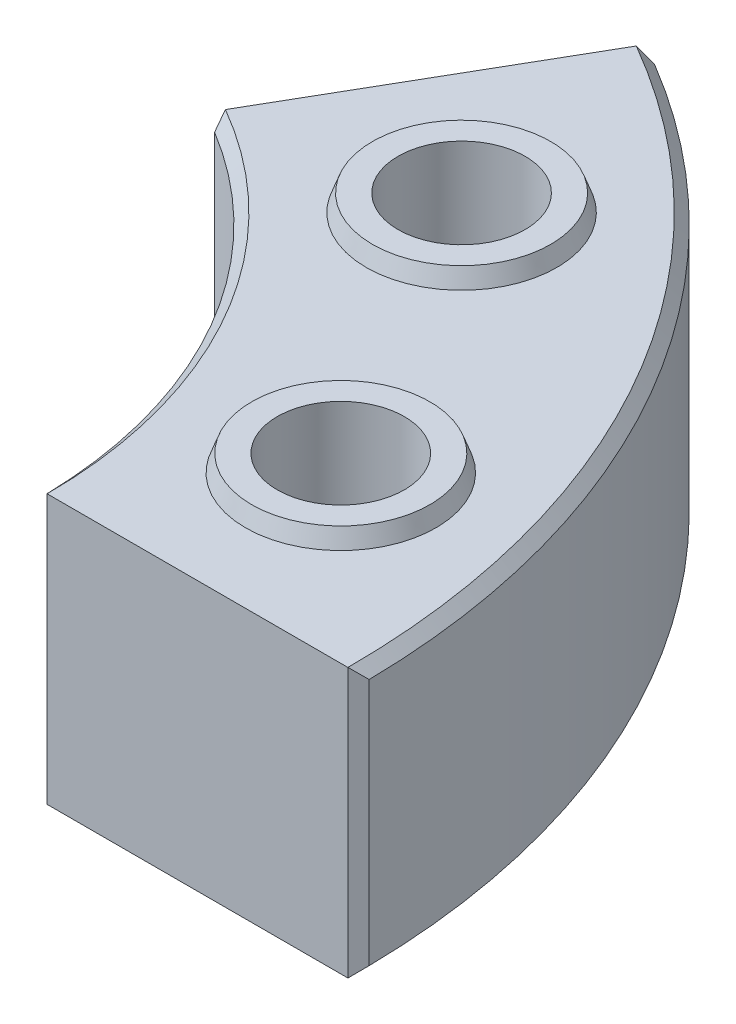
ISO-10303-21;
HEADER;
FILE_DESCRIPTION(('STEP AP214'),'2;1');
FILE_NAME('part.step','',(''),(''),'','','');
FILE_SCHEMA(('AUTOMOTIVE_DESIGN { 1 0 10303 214 1 1 1 1 }'));
ENDSEC;
DATA;
#1=APPLICATION_CONTEXT('core data for automotive mechanical design processes');
#2=APPLICATION_PROTOCOL_DEFINITION('international standard','automotive_design',2000,#1);
#3=PRODUCT_CONTEXT('',#1,'mechanical');
#4=PRODUCT('Part','Part','',(#3));
#5=PRODUCT_RELATED_PRODUCT_CATEGORY('part','',(#4));
#6=PRODUCT_DEFINITION_FORMATION('','',#4);
#7=PRODUCT_DEFINITION_CONTEXT('part definition',#1,'design');
#8=PRODUCT_DEFINITION('design','',#6,#7);
#9=PRODUCT_DEFINITION_SHAPE('','',#8);
#10=(LENGTH_UNIT() NAMED_UNIT(*) SI_UNIT(.MILLI.,.METRE.));
#11=(NAMED_UNIT(*) PLANE_ANGLE_UNIT() SI_UNIT($,.RADIAN.));
#12=(NAMED_UNIT(*) SI_UNIT($,.STERADIAN.) SOLID_ANGLE_UNIT());
#13=UNCERTAINTY_MEASURE_WITH_UNIT(LENGTH_MEASURE(1.E-05),#10,'distance_accuracy_value','');
#14=(GEOMETRIC_REPRESENTATION_CONTEXT(3) GLOBAL_UNCERTAINTY_ASSIGNED_CONTEXT((#13)) GLOBAL_UNIT_ASSIGNED_CONTEXT((#10,
#11,#12)) REPRESENTATION_CONTEXT('',''));
#15=CARTESIAN_POINT('',(0.,0.,0.));
#16=DIRECTION('',(0.,0.,1.));
#17=DIRECTION('',(1.,0.,0.));
#18=AXIS2_PLACEMENT_3D('',#15,#16,#17);
#19=CARTESIAN_POINT('',(212.839141137151,-127.,-212.839141137151));
#20=DIRECTION('',(0.,1.,0.));
#21=DIRECTION('',(0.,0.,1.));
#22=AXIS2_PLACEMENT_3D('',#19,#20,#21);
#23=CYLINDRICAL_SURFACE('',#22,30.);
#24=CARTESIAN_POINT('',(212.839141137151,8.,-212.839141137151));
#25=DIRECTION('',(0.,1.,0.));
#26=DIRECTION('',(0.,0.,1.));
#27=AXIS2_PLACEMENT_3D('',#24,#25,#26);
#28=CIRCLE('',#27,30.);
#29=CARTESIAN_POINT('',(212.839141137151,8.,-182.839141137151));
#30=VERTEX_POINT('',#29);
#31=EDGE_CURVE('E399',#30,#30,#28,.T.);
#32=ORIENTED_EDGE('',*,*,#31,.T.);
#33=EDGE_LOOP('',(#32));
#34=FACE_BOUND('',#33,.T.);
#35=CARTESIAN_POINT('',(212.839141137151,-117.,-212.839141137151));
#36=DIRECTION('',(0.,-1.,0.));
#37=DIRECTION('',(0.,0.,-1.));
#38=AXIS2_PLACEMENT_3D('',#35,#36,#37);
#39=CIRCLE('',#38,30.);
#40=CARTESIAN_POINT('',(212.839141137151,-117.,-242.839141137151));
#41=VERTEX_POINT('',#40);
#42=EDGE_CURVE('E239',#41,#41,#39,.T.);
#43=ORIENTED_EDGE('',*,*,#42,.T.);
#44=EDGE_LOOP('',(#43));
#45=FACE_BOUND('',#44,.T.);
#46=ADVANCED_FACE('F35',(#34,#45),#23,.F.);
#47=CARTESIAN_POINT('',(290.743673713006,-127.,-77.9045325758727));
#48=DIRECTION('',(0.,1.,0.));
#49=DIRECTION('',(0.,0.,1.));
#50=AXIS2_PLACEMENT_3D('',#47,#48,#49);
#51=CYLINDRICAL_SURFACE('',#50,30.);
#52=CARTESIAN_POINT('',(290.743673713006,8.,-77.9045325758727));
#53=DIRECTION('',(0.,1.,0.));
#54=DIRECTION('',(0.,0.,1.));
#55=AXIS2_PLACEMENT_3D('',#52,#53,#54);
#56=CIRCLE('',#55,30.);
#57=CARTESIAN_POINT('',(290.743673713006,8.,-47.9045325758727));
#58=VERTEX_POINT('',#57);
#59=EDGE_CURVE('E405',#58,#58,#56,.T.);
#60=ORIENTED_EDGE('',*,*,#59,.T.);
#61=EDGE_LOOP('',(#60));
#62=FACE_BOUND('',#61,.T.);
#63=CARTESIAN_POINT('',(290.743673713006,-117.,-77.9045325758727));
#64=DIRECTION('',(0.,-1.,0.));
#65=DIRECTION('',(0.,0.,-1.));
#66=AXIS2_PLACEMENT_3D('',#63,#64,#65);
#67=CIRCLE('',#66,30.);
#68=CARTESIAN_POINT('',(290.743673713006,-117.,-107.904532575873));
#69=VERTEX_POINT('',#68);
#70=EDGE_CURVE('E431',#69,#69,#67,.T.);
#71=ORIENTED_EDGE('',*,*,#70,.T.);
#72=EDGE_LOOP('',(#71));
#73=FACE_BOUND('',#72,.T.);
#74=ADVANCED_FACE('F283',(#62,#73),#51,.F.);
#75=CARTESIAN_POINT('',(0.,0.,0.));
#76=DIRECTION('',(0.,1.,0.));
#77=DIRECTION('',(0.,0.,1.));
#78=AXIS2_PLACEMENT_3D('',#75,#76,#77);
#79=PLANE('',#78);
#80=CARTESIAN_POINT('',(212.839141137151,0.,-212.839141137151));
#81=DIRECTION('',(0.,1.,0.));
#82=DIRECTION('',(0.,0.,1.));
#83=AXIS2_PLACEMENT_3D('',#80,#81,#82);
#84=CIRCLE('',#83,45.);
#85=CARTESIAN_POINT('',(212.839141137151,0.,-167.839141137151));
#86=VERTEX_POINT('',#85);
#87=EDGE_CURVE('E386',#86,#86,#84,.T.);
#88=ORIENTED_EDGE('',*,*,#87,.F.);
#89=EDGE_LOOP('',(#88));
#90=FACE_BOUND('',#89,.T.);
#91=DIRECTION('',(-0.500000000000001,0.,0.866025403784438));
#92=VECTOR('',#91,1.);
#93=CARTESIAN_POINT('',(188.499999999988,0.,-326.49157722674));
#94=LINE('',#93,#92);
#95=CARTESIAN_POINT('',(185.983198165844,0.,-322.13234857742));
#96=VERTEX_POINT('',#95);
#97=CARTESIAN_POINT('',(114.999999999988,0.,-199.185842870428));
#98=VERTEX_POINT('',#97);
#99=EDGE_CURVE('E379',#96,#98,#94,.T.);
#100=ORIENTED_EDGE('',*,*,#99,.T.);
#101=CARTESIAN_POINT('',(0.,0.,0.));
#102=DIRECTION('',(0.,1.,0.));
#103=DIRECTION('',(0.,0.,1.));
#104=AXIS2_PLACEMENT_3D('',#101,#102,#103);
#105=CIRCLE('',#104,230.);
#106=CARTESIAN_POINT('',(230.,0.,0.));
#107=VERTEX_POINT('',#106);
#108=EDGE_CURVE('E191',#98,#107,#105,.F.);
#109=ORIENTED_EDGE('',*,*,#108,.T.);
#110=DIRECTION('',(1.,0.,0.));
#111=VECTOR('',#110,1.);
#112=CARTESIAN_POINT('',(225.,0.,0.));
#113=LINE('',#112,#111);
#114=CARTESIAN_POINT('',(371.966396331712,0.,0.));
#115=VERTEX_POINT('',#114);
#116=EDGE_CURVE('E372',#107,#115,#113,.T.);
#117=ORIENTED_EDGE('',*,*,#116,.T.);
#118=DIRECTION('',(-0.702338643314229,0.,0.711842981357215));
#119=VECTOR('',#118,1.);
#120=CARTESIAN_POINT('',(188.482972334752,0.,185.966397849462));
#121=LINE('',#120,#119);
#122=CARTESIAN_POINT('',(371.999998441039,0.,-0.0340568270174596));
#123=VERTEX_POINT('',#122);
#124=EDGE_CURVE('E187',#115,#123,#121,.F.);
#125=ORIENTED_EDGE('',*,*,#124,.T.);
#126=CARTESIAN_POINT('',(0.,0.,0.));
#127=DIRECTION('',(0.,1.,0.));
#128=DIRECTION('',(0.,0.,1.));
#129=AXIS2_PLACEMENT_3D('',#126,#127,#128);
#130=CIRCLE('',#129,372.);
#131=CARTESIAN_POINT('',(186.029493297877,0.,-322.144420444209));
#132=VERTEX_POINT('',#131);
#133=EDGE_CURVE('E185',#123,#132,#130,.T.);
#134=ORIENTED_EDGE('',*,*,#133,.T.);
#135=DIRECTION('',(0.967643427018109,0.,-0.252321616491037));
#136=VECTOR('',#135,1.);
#137=CARTESIAN_POINT('',(-66.8101386205494,0.,-256.214241147428));
#138=LINE('',#137,#136);
#139=EDGE_CURVE('E189',#132,#96,#138,.F.);
#140=ORIENTED_EDGE('',*,*,#139,.T.);
#141=EDGE_LOOP('',(#100,#109,#117,#125,#134,#140));
#142=FACE_BOUND('',#141,.T.);
#143=CARTESIAN_POINT('',(290.743673713006,0.,-77.9045325758727));
#144=DIRECTION('',(0.,1.,0.));
#145=DIRECTION('',(0.,0.,1.));
#146=AXIS2_PLACEMENT_3D('',#143,#144,#145);
#147=CIRCLE('',#146,45.);
#148=CARTESIAN_POINT('',(290.743673713006,0.,-32.9045325758727));
#149=VERTEX_POINT('',#148);
#150=EDGE_CURVE('E400',#149,#149,#147,.T.);
#151=ORIENTED_EDGE('',*,*,#150,.F.);
#152=EDGE_LOOP('',(#151));
#153=FACE_BOUND('',#152,.T.);
#154=ADVANCED_FACE('F289',(#90,#142,#153),#79,.T.);
#155=CARTESIAN_POINT('',(0.,-127.,0.));
#156=DIRECTION('',(0.,1.,0.));
#157=DIRECTION('',(0.,0.,1.));
#158=AXIS2_PLACEMENT_3D('',#155,#156,#157);
#159=CYLINDRICAL_SURFACE('',#158,225.);
#160=CARTESIAN_POINT('',(0.,-122.,0.));
#161=DIRECTION('',(0.,1.,0.));
#162=DIRECTION('',(0.,0.,1.));
#163=AXIS2_PLACEMENT_3D('',#160,#161,#162);
#164=CIRCLE('',#163,225.);
#165=CARTESIAN_POINT('',(116.709407505567,-122.,-192.364014825277));
#166=VERTEX_POINT('',#165);
#167=CARTESIAN_POINT('',(224.94682736544,-122.,-4.89130434782609));
#168=VERTEX_POINT('',#167);
#169=EDGE_CURVE('E155',#166,#168,#164,.F.);
#170=ORIENTED_EDGE('',*,*,#169,.T.);
#171=DIRECTION('',(0.,1.,0.));
#172=VECTOR('',#171,1.);
#173=CARTESIAN_POINT('',(224.94682736544,-127.,-4.89130434782609));
#174=LINE('',#173,#172);
#175=CARTESIAN_POINT('',(224.94682736544,-5.00000000000001,-4.89130434782609));
#176=VERTEX_POINT('',#175);
#177=EDGE_CURVE('E135',#168,#176,#174,.T.);
#178=ORIENTED_EDGE('',*,*,#177,.T.);
#179=CARTESIAN_POINT('',(0.,-5.,0.));
#180=DIRECTION('',(0.,1.,0.));
#181=DIRECTION('',(0.,0.,1.));
#182=AXIS2_PLACEMENT_3D('',#179,#180,#181);
#183=CIRCLE('',#182,225.);
#184=CARTESIAN_POINT('',(116.709407505567,-5.00000000000001,-192.364014825277));
#185=VERTEX_POINT('',#184);
#186=EDGE_CURVE('E143',#176,#185,#183,.T.);
#187=ORIENTED_EDGE('',*,*,#186,.T.);
#188=DIRECTION('',(0.,1.,0.));
#189=VECTOR('',#188,1.);
#190=CARTESIAN_POINT('',(116.709407505567,-127.,-192.364014825277));
#191=LINE('',#190,#189);
#192=EDGE_CURVE('E150',#185,#166,#191,.F.);
#193=ORIENTED_EDGE('',*,*,#192,.T.);
#194=EDGE_LOOP('',(#170,#178,#187,#193));
#195=FACE_BOUND('',#194,.T.);
#196=ADVANCED_FACE('F153',(#195),#159,.F.);
#197=CARTESIAN_POINT('',(188.499999999988,-127.,-326.49157722674));
#198=DIRECTION('',(-0.866025403784438,0.,-0.500000000000001));
#199=DIRECTION('',(-0.500000000000001,0.,0.866025403784438));
#200=AXIS2_PLACEMENT_3D('',#197,#198,#199);
#201=PLANE('',#200);
#202=DIRECTION('',(-0.500000000000001,0.,0.866025403784438));
#203=VECTOR('',#202,1.);
#204=CARTESIAN_POINT('',(188.499999999988,-127.,-326.49157722674));
#205=LINE('',#204,#203);
#206=CARTESIAN_POINT('',(185.983198165844,-127.,-322.13234857742));
#207=VERTEX_POINT('',#206);
#208=CARTESIAN_POINT('',(114.999999999988,-127.,-199.185842870428));
#209=VERTEX_POINT('',#208);
#210=EDGE_CURVE('E384',#207,#209,#205,.T.);
#211=ORIENTED_EDGE('',*,*,#210,.T.);
#212=DIRECTION('',(0.353553390593276,-0.707106781186546,-0.612372435695796));
#213=VECTOR('',#212,1.);
#214=CARTESIAN_POINT('',(-1.23309982264346E-11,102.999999999999,-7.11930514540883E-12));
#215=LINE('',#214,#213);
#216=CARTESIAN_POINT('',(114.972822875657,-126.945645751339,-199.138770710284));
#217=VERTEX_POINT('',#216);
#218=EDGE_CURVE('E183',#209,#217,#215,.F.);
#219=ORIENTED_EDGE('',*,*,#218,.T.);
#220=DIRECTION('',(0.,1.,0.));
#221=VECTOR('',#220,1.);
#222=CARTESIAN_POINT('',(114.972822875657,-127.,-199.138770710284));
#223=LINE('',#222,#221);
#224=CARTESIAN_POINT('',(114.972822875657,-0.054354248661348,-199.138770710284));
#225=VERTEX_POINT('',#224);
#226=EDGE_CURVE('E181',#217,#225,#223,.T.);
#227=ORIENTED_EDGE('',*,*,#226,.T.);
#228=DIRECTION('',(-0.353553390593276,-0.707106781186546,0.612372435695796));
#229=VECTOR('',#228,1.);
#230=CARTESIAN_POINT('',(-1.23309982264346E-11,-229.999999999999,-7.11930514540883E-12));
#231=LINE('',#230,#229);
#232=EDGE_CURVE('E179',#225,#98,#231,.F.);
#233=ORIENTED_EDGE('',*,*,#232,.T.);
#234=ORIENTED_EDGE('',*,*,#99,.F.);
#235=DIRECTION('',(0.,-1.,0.));
#236=VECTOR('',#235,1.);
#237=CARTESIAN_POINT('',(185.983198165844,-127.,-322.13234857742));
#238=LINE('',#237,#236);
#239=EDGE_CURVE('E176',#96,#207,#238,.T.);
#240=ORIENTED_EDGE('',*,*,#239,.T.);
#241=EDGE_LOOP('',(#211,#219,#227,#233,#234,#240));
#242=FACE_BOUND('',#241,.T.);
#243=ADVANCED_FACE('F305',(#242),#201,.T.);
#244=CARTESIAN_POINT('',(0.,-127.,0.));
#245=DIRECTION('',(0.,1.,0.));
#246=DIRECTION('',(0.,0.,1.));
#247=AXIS2_PLACEMENT_3D('',#244,#245,#246);
#248=CYLINDRICAL_SURFACE('',#247,377.);
#249=CARTESIAN_POINT('',(0.,-122.,0.));
#250=DIRECTION('',(0.,1.,0.));
#251=DIRECTION('',(0.,0.,1.));
#252=AXIS2_PLACEMENT_3D('',#249,#250,#251);
#253=CIRCLE('',#252,377.);
#254=CARTESIAN_POINT('',(376.965944669504,-122.,-5.0672043010751));
#255=VERTEX_POINT('',#254);
#256=CARTESIAN_POINT('',(192.871299985636,-122.,-323.928482294859));
#257=VERTEX_POINT('',#256);
#258=EDGE_CURVE('E50',#255,#257,#253,.T.);
#259=ORIENTED_EDGE('',*,*,#258,.T.);
#260=DIRECTION('',(0.,1.,0.));
#261=VECTOR('',#260,1.);
#262=CARTESIAN_POINT('',(192.871299985636,-127.,-323.928482294859));
#263=LINE('',#262,#261);
#264=CARTESIAN_POINT('',(192.871299985636,-4.99999999999984,-323.928482294859));
#265=VERTEX_POINT('',#264);
#266=EDGE_CURVE('E11',#257,#265,#263,.T.);
#267=ORIENTED_EDGE('',*,*,#266,.T.);
#268=CARTESIAN_POINT('',(0.,-4.99999999999984,0.));
#269=DIRECTION('',(0.,1.,0.));
#270=DIRECTION('',(0.,0.,1.));
#271=AXIS2_PLACEMENT_3D('',#268,#269,#270);
#272=CIRCLE('',#271,377.);
#273=CARTESIAN_POINT('',(376.965944669504,-4.99999999999984,-5.0672043010751));
#274=VERTEX_POINT('',#273);
#275=EDGE_CURVE('E193',#265,#274,#272,.F.);
#276=ORIENTED_EDGE('',*,*,#275,.T.);
#277=DIRECTION('',(0.,1.,0.));
#278=VECTOR('',#277,1.);
#279=CARTESIAN_POINT('',(376.965944669504,-127.,-5.0672043010751));
#280=LINE('',#279,#278);
#281=EDGE_CURVE('E61',#274,#255,#280,.F.);
#282=ORIENTED_EDGE('',*,*,#281,.T.);
#283=EDGE_LOOP('',(#259,#267,#276,#282));
#284=FACE_BOUND('',#283,.T.);
#285=ADVANCED_FACE('F308',(#284),#248,.T.);
#286=CARTESIAN_POINT('',(225.,-127.,0.));
#287=DIRECTION('',(0.,0.,1.));
#288=DIRECTION('',(1.,0.,0.));
#289=AXIS2_PLACEMENT_3D('',#286,#287,#288);
#290=PLANE('',#289);
#291=DIRECTION('',(0.,-1.,0.));
#292=VECTOR('',#291,1.);
#293=CARTESIAN_POINT('',(229.945645751338,-127.,0.));
#294=LINE('',#293,#292);
#295=CARTESIAN_POINT('',(229.945645751338,-0.0543542486616255,0.));
#296=VERTEX_POINT('',#295);
#297=CARTESIAN_POINT('',(229.945645751338,-126.945645751338,0.));
#298=VERTEX_POINT('',#297);
#299=EDGE_CURVE('E137',#296,#298,#294,.T.);
#300=ORIENTED_EDGE('',*,*,#299,.T.);
#301=DIRECTION('',(-0.707106781186549,0.707106781186546,0.));
#302=VECTOR('',#301,1.);
#303=CARTESIAN_POINT('',(0.,102.999999999999,0.));
#304=LINE('',#303,#302);
#305=CARTESIAN_POINT('',(230.,-127.,0.));
#306=VERTEX_POINT('',#305);
#307=EDGE_CURVE('E166',#298,#306,#304,.F.);
#308=ORIENTED_EDGE('',*,*,#307,.T.);
#309=DIRECTION('',(1.,0.,0.));
#310=VECTOR('',#309,1.);
#311=CARTESIAN_POINT('',(225.,-127.,0.));
#312=LINE('',#311,#310);
#313=CARTESIAN_POINT('',(371.966396331712,-127.,0.));
#314=VERTEX_POINT('',#313);
#315=EDGE_CURVE('E382',#306,#314,#312,.T.);
#316=ORIENTED_EDGE('',*,*,#315,.T.);
#317=DIRECTION('',(0.,1.,0.));
#318=VECTOR('',#317,1.);
#319=CARTESIAN_POINT('',(371.966396331712,-127.,0.));
#320=LINE('',#319,#318);
#321=EDGE_CURVE('E157',#314,#115,#320,.T.);
#322=ORIENTED_EDGE('',*,*,#321,.T.);
#323=ORIENTED_EDGE('',*,*,#116,.F.);
#324=DIRECTION('',(0.707106781186549,0.707106781186546,0.));
#325=VECTOR('',#324,1.);
#326=CARTESIAN_POINT('',(0.,-229.999999999999,0.));
#327=LINE('',#326,#325);
#328=EDGE_CURVE('E159',#107,#296,#327,.F.);
#329=ORIENTED_EDGE('',*,*,#328,.T.);
#330=EDGE_LOOP('',(#300,#308,#316,#322,#323,#329));
#331=FACE_BOUND('',#330,.T.);
#332=ADVANCED_FACE('F300',(#331),#290,.T.);
#333=CARTESIAN_POINT('',(0.,-127.,0.));
#334=DIRECTION('',(0.,1.,0.));
#335=DIRECTION('',(0.,0.,1.));
#336=AXIS2_PLACEMENT_3D('',#333,#334,#335);
#337=PLANE('',#336);
#338=CARTESIAN_POINT('',(290.743673713006,-127.,-77.9045325758727));
#339=DIRECTION('',(0.,-1.,0.));
#340=DIRECTION('',(0.,0.,-1.));
#341=AXIS2_PLACEMENT_3D('',#338,#339,#340);
#342=CIRCLE('',#341,46.);
#343=CARTESIAN_POINT('',(290.743673713006,-127.,-123.904532575873));
#344=VERTEX_POINT('',#343);
#345=EDGE_CURVE('E353',#344,#344,#342,.T.);
#346=ORIENTED_EDGE('',*,*,#345,.F.);
#347=EDGE_LOOP('',(#346));
#348=FACE_BOUND('',#347,.T.);
#349=CARTESIAN_POINT('',(212.839141137151,-127.,-212.839141137151));
#350=DIRECTION('',(0.,-1.,0.));
#351=DIRECTION('',(0.,0.,-1.));
#352=AXIS2_PLACEMENT_3D('',#349,#350,#351);
#353=CIRCLE('',#352,46.);
#354=CARTESIAN_POINT('',(212.839141137151,-127.,-258.839141137151));
#355=VERTEX_POINT('',#354);
#356=EDGE_CURVE('E428',#355,#355,#353,.T.);
#357=ORIENTED_EDGE('',*,*,#356,.F.);
#358=EDGE_LOOP('',(#357));
#359=FACE_BOUND('',#358,.T.);
#360=ORIENTED_EDGE('',*,*,#315,.F.);
#361=CARTESIAN_POINT('',(0.,-127.,0.));
#362=DIRECTION('',(0.,1.,0.));
#363=DIRECTION('',(0.,0.,1.));
#364=AXIS2_PLACEMENT_3D('',#361,#362,#363);
#365=CIRCLE('',#364,230.);
#366=EDGE_CURVE('E174',#306,#209,#365,.T.);
#367=ORIENTED_EDGE('',*,*,#366,.T.);
#368=ORIENTED_EDGE('',*,*,#210,.F.);
#369=DIRECTION('',(-0.967643427018109,0.,0.252321616491037));
#370=VECTOR('',#369,1.);
#371=CARTESIAN_POINT('',(192.871299985637,-127.,-323.928482294859));
#372=LINE('',#371,#370);
#373=CARTESIAN_POINT('',(186.029493297876,-127.,-322.144420444209));
#374=VERTEX_POINT('',#373);
#375=EDGE_CURVE('E172',#207,#374,#372,.F.);
#376=ORIENTED_EDGE('',*,*,#375,.T.);
#377=CARTESIAN_POINT('',(0.,-127.,0.));
#378=DIRECTION('',(0.,1.,0.));
#379=DIRECTION('',(0.,0.,1.));
#380=AXIS2_PLACEMENT_3D('',#377,#378,#379);
#381=CIRCLE('',#380,372.);
#382=CARTESIAN_POINT('',(371.999998441038,-127.,-0.0340568270174034));
#383=VERTEX_POINT('',#382);
#384=EDGE_CURVE('E170',#374,#383,#381,.F.);
#385=ORIENTED_EDGE('',*,*,#384,.T.);
#386=DIRECTION('',(0.702338643314229,0.,-0.711842981357215));
#387=VECTOR('',#386,1.);
#388=CARTESIAN_POINT('',(371.966396331712,-127.,0.));
#389=LINE('',#388,#387);
#390=EDGE_CURVE('E168',#383,#314,#389,.F.);
#391=ORIENTED_EDGE('',*,*,#390,.T.);
#392=EDGE_LOOP('',(#360,#367,#368,#376,#385,#391));
#393=FACE_BOUND('',#392,.T.);
#394=ADVANCED_FACE('F296',(#348,#359,#393),#337,.F.);
#395=CARTESIAN_POINT('',(212.839141137151,8.,-212.839141137151));
#396=DIRECTION('',(0.,1.,0.));
#397=DIRECTION('',(0.,0.,1.));
#398=AXIS2_PLACEMENT_3D('',#395,#396,#397);
#399=PLANE('',#398);
#400=CARTESIAN_POINT('',(212.839141137151,8.,-212.839141137151));
#401=DIRECTION('',(0.,1.,0.));
#402=DIRECTION('',(0.,0.,1.));
#403=AXIS2_PLACEMENT_3D('',#400,#401,#402);
#404=CIRCLE('',#403,42.0882381258705);
#405=CARTESIAN_POINT('',(212.839141137151,8.,-170.750903011281));
#406=VERTEX_POINT('',#405);
#407=EDGE_CURVE('E360',#406,#406,#404,.T.);
#408=ORIENTED_EDGE('',*,*,#407,.T.);
#409=EDGE_LOOP('',(#408));
#410=FACE_BOUND('',#409,.T.);
#411=ORIENTED_EDGE('',*,*,#31,.F.);
#412=EDGE_LOOP('',(#411));
#413=FACE_BOUND('',#412,.T.);
#414=ADVANCED_FACE('F299',(#410,#413),#399,.T.);
#415=CARTESIAN_POINT('',(290.743673713006,8.,-77.9045325758727));
#416=DIRECTION('',(0.,1.,0.));
#417=DIRECTION('',(0.,0.,1.));
#418=AXIS2_PLACEMENT_3D('',#415,#416,#417);
#419=PLANE('',#418);
#420=CARTESIAN_POINT('',(290.743673713006,8.,-77.9045325758727));
#421=DIRECTION('',(0.,1.,0.));
#422=DIRECTION('',(0.,0.,1.));
#423=AXIS2_PLACEMENT_3D('',#420,#421,#422);
#424=CIRCLE('',#423,42.0882381258704);
#425=CARTESIAN_POINT('',(290.743673713006,8.,-35.8162944500023));
#426=VERTEX_POINT('',#425);
#427=EDGE_CURVE('E390',#426,#426,#424,.T.);
#428=ORIENTED_EDGE('',*,*,#427,.T.);
#429=EDGE_LOOP('',(#428));
#430=FACE_BOUND('',#429,.T.);
#431=ORIENTED_EDGE('',*,*,#59,.F.);
#432=EDGE_LOOP('',(#431));
#433=FACE_BOUND('',#432,.T.);
#434=ADVANCED_FACE('F325',(#430,#433),#419,.T.);
#435=CARTESIAN_POINT('',(290.743673713006,8.,-77.9045325758727));
#436=DIRECTION('',(0.,-1.,0.));
#437=DIRECTION('',(0.,0.,-1.));
#438=AXIS2_PLACEMENT_3D('',#435,#436,#437);
#439=CONICAL_SURFACE('',#438,42.0882381258704,0.349065850398864);
#440=ORIENTED_EDGE('',*,*,#150,.T.);
#441=EDGE_LOOP('',(#440));
#442=FACE_BOUND('',#441,.T.);
#443=ORIENTED_EDGE('',*,*,#427,.F.);
#444=EDGE_LOOP('',(#443));
#445=FACE_BOUND('',#444,.T.);
#446=ADVANCED_FACE('F318',(#442,#445),#439,.T.);
#447=CARTESIAN_POINT('',(212.839141137151,8.,-212.839141137151));
#448=DIRECTION('',(0.,-1.,0.));
#449=DIRECTION('',(0.,0.,-1.));
#450=AXIS2_PLACEMENT_3D('',#447,#448,#449);
#451=CONICAL_SURFACE('',#450,42.0882381258705,0.349065850398855);
#452=ORIENTED_EDGE('',*,*,#87,.T.);
#453=EDGE_LOOP('',(#452));
#454=FACE_BOUND('',#453,.T.);
#455=ORIENTED_EDGE('',*,*,#407,.F.);
#456=EDGE_LOOP('',(#455));
#457=FACE_BOUND('',#456,.T.);
#458=ADVANCED_FACE('F324',(#454,#457),#451,.T.);
#459=CARTESIAN_POINT('',(290.743673713006,-117.,-77.9045325758727));
#460=DIRECTION('',(0.,-1.,0.));
#461=DIRECTION('',(0.,0.,-1.));
#462=AXIS2_PLACEMENT_3D('',#459,#460,#461);
#463=PLANE('',#462);
#464=CARTESIAN_POINT('',(290.743673713006,-117.,-77.9045325758727));
#465=DIRECTION('',(0.,-1.,0.));
#466=DIRECTION('',(0.,0.,-1.));
#467=AXIS2_PLACEMENT_3D('',#464,#465,#466);
#468=CIRCLE('',#467,42.3602976573379);
#469=CARTESIAN_POINT('',(290.743673713006,-117.,-120.264830233211));
#470=VERTEX_POINT('',#469);
#471=EDGE_CURVE('E151',#470,#470,#468,.T.);
#472=ORIENTED_EDGE('',*,*,#471,.T.);
#473=EDGE_LOOP('',(#472));
#474=FACE_BOUND('',#473,.T.);
#475=ORIENTED_EDGE('',*,*,#70,.F.);
#476=EDGE_LOOP('',(#475));
#477=FACE_BOUND('',#476,.T.);
#478=ADVANCED_FACE('F332',(#474,#477),#463,.T.);
#479=CARTESIAN_POINT('',(212.839141137151,-117.,-212.839141137151));
#480=DIRECTION('',(0.,-1.,0.));
#481=DIRECTION('',(0.,0.,-1.));
#482=AXIS2_PLACEMENT_3D('',#479,#480,#481);
#483=PLANE('',#482);
#484=CARTESIAN_POINT('',(212.839141137151,-117.,-212.839141137151));
#485=DIRECTION('',(0.,-1.,0.));
#486=DIRECTION('',(0.,0.,-1.));
#487=AXIS2_PLACEMENT_3D('',#484,#485,#486);
#488=CIRCLE('',#487,42.3602976573379);
#489=CARTESIAN_POINT('',(212.839141137151,-117.,-255.199438794489));
#490=VERTEX_POINT('',#489);
#491=EDGE_CURVE('E357',#490,#490,#488,.T.);
#492=ORIENTED_EDGE('',*,*,#491,.T.);
#493=EDGE_LOOP('',(#492));
#494=FACE_BOUND('',#493,.T.);
#495=ORIENTED_EDGE('',*,*,#42,.F.);
#496=EDGE_LOOP('',(#495));
#497=FACE_BOUND('',#496,.T.);
#498=ADVANCED_FACE('F340',(#494,#497),#483,.T.);
#499=CARTESIAN_POINT('',(212.839141137151,-117.,-212.839141137151));
#500=DIRECTION('',(0.,-1.,0.));
#501=DIRECTION('',(0.,0.,-1.));
#502=AXIS2_PLACEMENT_3D('',#499,#500,#501);
#503=CONICAL_SURFACE('',#502,42.3602976573379,0.349065850398871);
#504=ORIENTED_EDGE('',*,*,#356,.T.);
#505=EDGE_LOOP('',(#504));
#506=FACE_BOUND('',#505,.T.);
#507=ORIENTED_EDGE('',*,*,#491,.F.);
#508=EDGE_LOOP('',(#507));
#509=FACE_BOUND('',#508,.T.);
#510=ADVANCED_FACE('F334',(#506,#509),#503,.F.);
#511=CARTESIAN_POINT('',(290.743673713006,-117.,-77.9045325758727));
#512=DIRECTION('',(0.,-1.,0.));
#513=DIRECTION('',(0.,0.,-1.));
#514=AXIS2_PLACEMENT_3D('',#511,#512,#513);
#515=CONICAL_SURFACE('',#514,42.3602976573378,0.349065850398872);
#516=CARTESIAN_POINT('',(290.743673713006,-127.,-123.904532575873));
#517=CARTESIAN_POINT('',(290.743673713006,-126.895833333333,-123.866619009803));
#518=CARTESIAN_POINT('',(290.743673713006,-126.791666666667,-123.828705443734));
#519=CARTESIAN_POINT('',(290.743673713006,-126.583333333333,-123.752878311595));
#520=CARTESIAN_POINT('',(290.743673713006,-126.479166666667,-123.714964745526));
#521=CARTESIAN_POINT('',(290.743673713006,-126.270833333333,-123.639137613387));
#522=CARTESIAN_POINT('',(290.743673713006,-126.166666666667,-123.601224047317));
#523=CARTESIAN_POINT('',(290.743673713006,-125.958333333333,-123.525396915179));
#524=CARTESIAN_POINT('',(290.743673713006,-125.854166666667,-123.487483349109));
#525=CARTESIAN_POINT('',(290.743673713006,-125.645833333333,-123.41165621697));
#526=CARTESIAN_POINT('',(290.743673713006,-125.541666666667,-123.373742650901));
#527=CARTESIAN_POINT('',(290.743673713006,-125.333333333333,-123.297915518762));
#528=CARTESIAN_POINT('',(290.743673713006,-125.229166666667,-123.260001952693));
#529=CARTESIAN_POINT('',(290.743673713006,-125.020833333333,-123.184174820554));
#530=CARTESIAN_POINT('',(290.743673713006,-124.916666666667,-123.146261254485));
#531=CARTESIAN_POINT('',(290.743673713006,-124.708333333333,-123.070434122346));
#532=CARTESIAN_POINT('',(290.743673713006,-124.604166666667,-123.032520556276));
#533=CARTESIAN_POINT('',(290.743673713006,-124.395833333333,-122.956693424138));
#534=CARTESIAN_POINT('',(290.743673713006,-124.291666666667,-122.918779858068));
#535=CARTESIAN_POINT('',(290.743673713006,-124.083333333333,-122.84295272593));
#536=CARTESIAN_POINT('',(290.743673713006,-123.979166666667,-122.80503915986));
#537=CARTESIAN_POINT('',(290.743673713006,-123.770833333333,-122.729212027721));
#538=CARTESIAN_POINT('',(290.743673713006,-123.666666666667,-122.691298461652));
#539=CARTESIAN_POINT('',(290.743673713006,-123.458333333333,-122.615471329513));
#540=CARTESIAN_POINT('',(290.743673713006,-123.354166666667,-122.577557763444));
#541=CARTESIAN_POINT('',(290.743673713006,-123.145833333333,-122.501730631305));
#542=CARTESIAN_POINT('',(290.743673713006,-123.041666666667,-122.463817065236));
#543=CARTESIAN_POINT('',(290.743673713006,-122.833333333333,-122.387989933097));
#544=CARTESIAN_POINT('',(290.743673713006,-122.729166666667,-122.350076367027));
#545=CARTESIAN_POINT('',(290.743673713006,-122.520833333333,-122.274249234889));
#546=CARTESIAN_POINT('',(290.743673713006,-122.416666666667,-122.236335668819));
#547=CARTESIAN_POINT('',(290.743673713006,-122.208333333333,-122.16050853668));
#548=CARTESIAN_POINT('',(290.743673713006,-122.104166666667,-122.122594970611));
#549=CARTESIAN_POINT('',(290.743673713006,-121.895833333333,-122.046767838472));
#550=CARTESIAN_POINT('',(290.743673713006,-121.791666666667,-122.008854272403));
#551=CARTESIAN_POINT('',(290.743673713006,-121.583333333333,-121.933027140264));
#552=CARTESIAN_POINT('',(290.743673713006,-121.479166666667,-121.895113574195));
#553=CARTESIAN_POINT('',(290.743673713006,-121.270833333333,-121.819286442056));
#554=CARTESIAN_POINT('',(290.743673713006,-121.166666666667,-121.781372875986));
#555=CARTESIAN_POINT('',(290.743673713006,-120.958333333333,-121.705545743848));
#556=CARTESIAN_POINT('',(290.743673713006,-120.854166666667,-121.667632177778));
#557=CARTESIAN_POINT('',(290.743673713006,-120.645833333333,-121.591805045639));
#558=CARTESIAN_POINT('',(290.743673713006,-120.541666666667,-121.55389147957));
#559=CARTESIAN_POINT('',(290.743673713006,-120.333333333333,-121.478064347431));
#560=CARTESIAN_POINT('',(290.743673713006,-120.229166666667,-121.440150781362));
#561=CARTESIAN_POINT('',(290.743673713006,-120.020833333333,-121.364323649223));
#562=CARTESIAN_POINT('',(290.743673713006,-119.916666666667,-121.326410083154));
#563=CARTESIAN_POINT('',(290.743673713006,-119.708333333333,-121.250582951015));
#564=CARTESIAN_POINT('',(290.743673713006,-119.604166666667,-121.212669384945));
#565=CARTESIAN_POINT('',(290.743673713006,-119.395833333333,-121.136842252807));
#566=CARTESIAN_POINT('',(290.743673713006,-119.291666666667,-121.098928686737));
#567=CARTESIAN_POINT('',(290.743673713006,-119.083333333333,-121.023101554598));
#568=CARTESIAN_POINT('',(290.743673713006,-118.979166666667,-120.985187988529));
#569=CARTESIAN_POINT('',(290.743673713006,-118.770833333333,-120.90936085639));
#570=CARTESIAN_POINT('',(290.743673713006,-118.666666666667,-120.871447290321));
#571=CARTESIAN_POINT('',(290.743673713006,-118.458333333333,-120.795620158182));
#572=CARTESIAN_POINT('',(290.743673713006,-118.354166666667,-120.757706592113));
#573=CARTESIAN_POINT('',(290.743673713006,-118.145833333333,-120.681879459974));
#574=CARTESIAN_POINT('',(290.743673713006,-118.041666666667,-120.643965893904));
#575=CARTESIAN_POINT('',(290.743673713006,-117.833333333333,-120.568138761766));
#576=CARTESIAN_POINT('',(290.743673713006,-117.729166666667,-120.530225195696));
#577=CARTESIAN_POINT('',(290.743673713006,-117.520833333333,-120.454398063558));
#578=CARTESIAN_POINT('',(290.743673713006,-117.416666666667,-120.416484497488));
#579=CARTESIAN_POINT('',(290.743673713006,-117.208333333333,-120.340657365349));
#580=CARTESIAN_POINT('',(290.743673713006,-117.104166666667,-120.30274379928));
#581=CARTESIAN_POINT('',(290.743673713006,-117.,-120.264830233211));
#582=B_SPLINE_CURVE_WITH_KNOTS('',3,(#516,#517,#518,#519,#520,#521,#522,#523,#524,#525,#526,
#527,#528,#529,#530,#531,#532,#533,#534,#535,#536,#537,#538,#539,#540,#541,#542,#543,#544,#545,
#546,#547,#548,#549,#550,#551,#552,#553,#554,#555,#556,#557,#558,#559,#560,#561,#562,#563,#564,
#565,#566,#567,#568,#569,#570,#571,#572,#573,#574,#575,#576,#577,#578,#579,#580,#581),
.UNSPECIFIED.,.F.,.F.,(4,2,2,2,2,2,2,2,2,2,2,2,2,2,2,2,2,2,2,2,2,2,2,2,2,2,2,2,2,2,2,2,4),(0.,
0.332555553898716,0.665111107797432,0.997666661696147,1.33022221559486,1.66277776949361,
1.99533332339233,2.32788887729104,2.66044443118978,2.99299998508849,3.32555553898722,
3.65811109288594,3.99066664678465,4.32322220068338,4.6557777545821,4.98833330848083,
5.32088886237955,5.65344441627828,5.985999970177,6.31855552407572,6.65111107797444,
6.98366663187317,7.31622218577189,7.64877773967061,7.98133329356934,8.31388884746805,
8.64644440136678,8.9789999552655,9.31155550916423,9.64411106306295,9.97666661696167,
10.3092221708604,10.6417777247591),.UNSPECIFIED.);
#583=EDGE_CURVE('BSEAM339',#344,#470,#582,.T.);
#584=ORIENTED_EDGE('',*,*,#345,.T.);
#585=ORIENTED_EDGE('',*,*,#471,.F.);
#586=ORIENTED_EDGE('',*,*,#583,.T.);
#587=ORIENTED_EDGE('',*,*,#583,.F.);
#588=EDGE_LOOP('',(#584,#586,#585,#587));
#589=FACE_BOUND('',#588,.T.);
#590=ADVANCED_FACE('F339',(#589),#515,.F.);
#591=CARTESIAN_POINT('',(114.972822875657,-127.,-199.138770710284));
#592=DIRECTION('',(0.968682173738103,0.,-0.248303939320389));
#593=DIRECTION('',(0.,1.,0.));
#594=AXIS2_PLACEMENT_3D('',#591,#592,#593);
#595=PLANE('',#594);
#596=CARTESIAN_POINT('',(114.972822875657,-0.0543542486613477,-199.138770710284));
#597=CARTESIAN_POINT('',(115.117020703344,-0.469432427677354,-198.576226815274));
#598=CARTESIAN_POINT('',(115.261344903374,-0.88379872425891,-198.013189917063));
#599=CARTESIAN_POINT('',(115.550249781666,-1.71107045778114,-196.886115548958));
#600=CARTESIAN_POINT('',(115.694830458238,-2.12397590429154,-196.322078085655));
#601=CARTESIAN_POINT('',(115.984253946737,-2.94829438030313,-195.192980517823));
#602=CARTESIAN_POINT('',(116.129096758719,-3.35970740948488,-194.627920413076));
#603=CARTESIAN_POINT('',(116.419050257021,-4.18100770445106,-193.496755173463));
#604=CARTESIAN_POINT('',(116.564160945092,-4.59089496020411,-192.930650031764));
#605=CARTESIAN_POINT('',(116.709407505567,-5.00000000000002,-192.364014825277));
#606=B_SPLINE_CURVE_WITH_KNOTS('',3,(#596,#597,#598,#599,#600,#601,#602,#603,#604,#605),
.UNSPECIFIED.,.F.,.F.,(4,2,2,2,4),(0.,2.14145866173043,4.28290326913851,6.42434833486978,
8.56580745499216),.UNSPECIFIED.);
#607=EDGE_CURVE('E147',#225,#185,#606,.T.);
#608=ORIENTED_EDGE('',*,*,#607,.F.);
#609=ORIENTED_EDGE('',*,*,#226,.F.);
#610=CARTESIAN_POINT('',(114.972822875657,-126.945645751339,-199.138770710284));
#611=CARTESIAN_POINT('',(115.117020703344,-126.530567572323,-198.576226815274));
#612=CARTESIAN_POINT('',(115.261344903374,-126.116201275741,-198.013189917063));
#613=CARTESIAN_POINT('',(115.550249781666,-125.288929542219,-196.886115548958));
#614=CARTESIAN_POINT('',(115.694830458238,-124.876024095708,-196.322078085655));
#615=CARTESIAN_POINT('',(115.984253946737,-124.051705619697,-195.192980517823));
#616=CARTESIAN_POINT('',(116.129096758719,-123.640292590515,-194.627920413076));
#617=CARTESIAN_POINT('',(116.419050257021,-122.818992295549,-193.496755173463));
#618=CARTESIAN_POINT('',(116.564160945092,-122.409105039796,-192.930650031764));
#619=CARTESIAN_POINT('',(116.709407505567,-122.,-192.364014825277));
#620=B_SPLINE_CURVE_WITH_KNOTS('',3,(#610,#611,#612,#613,#614,#615,#616,#617,#618,#619),
.UNSPECIFIED.,.F.,.F.,(4,2,2,2,4),(0.,2.14145866173041,4.28290326913849,6.42434833486981,
8.56580745499216),.UNSPECIFIED.);
#621=EDGE_CURVE('E232',#166,#217,#620,.F.);
#622=ORIENTED_EDGE('',*,*,#621,.F.);
#623=ORIENTED_EDGE('',*,*,#192,.F.);
#624=EDGE_LOOP('',(#608,#609,#622,#623));
#625=FACE_BOUND('',#624,.T.);
#626=ADVANCED_FACE('F226',(#625),#595,.F.);
#627=CARTESIAN_POINT('',(0.,-122.,0.));
#628=DIRECTION('',(0.,-1.,0.));
#629=DIRECTION('',(0.,0.,-1.));
#630=AXIS2_PLACEMENT_3D('',#627,#628,#629);
#631=CONICAL_SURFACE('',#630,225.,0.785398163397451);
#632=ORIENTED_EDGE('',*,*,#366,.F.);
#633=ORIENTED_EDGE('',*,*,#307,.F.);
#634=CARTESIAN_POINT('',(229.945645751338,-126.945645751338,0.));
#635=CARTESIAN_POINT('',(229.530567361359,-126.530567572322,-0.406150929451819));
#636=CARTESIAN_POINT('',(229.115125204256,-126.116201275741,-0.812657802164434));
#637=CARTESIAN_POINT('',(228.283502608669,-125.288929542219,-1.62639395009486));
#638=CARTESIAN_POINT('',(227.867322175049,-124.876024095708,-2.03362322055405));
#639=CARTESIAN_POINT('',(227.034206742204,-124.051705619697,-2.84882009796168));
#640=CARTESIAN_POINT('',(226.617271742819,-123.640292590515,-3.25678770506812));
#641=CARTESIAN_POINT('',(225.782630658587,-122.818992295549,-4.07347742031985));
#642=CARTESIAN_POINT('',(225.364924568699,-122.409105039796,-4.4821995333994));
#643=CARTESIAN_POINT('',(224.94682736544,-122.,-4.89130434782611));
#644=B_SPLINE_CURVE_WITH_KNOTS('',3,(#634,#635,#636,#637,#638,#639,#640,#641,#642,#643),
.UNSPECIFIED.,.F.,.F.,(4,2,2,2,4),(0.,2.14145866173034,4.28290326913833,6.42434833486954,
8.56580745499183),.UNSPECIFIED.);
#645=EDGE_CURVE('E140',#168,#298,#644,.F.);
#646=ORIENTED_EDGE('',*,*,#645,.F.);
#647=ORIENTED_EDGE('',*,*,#169,.F.);
#648=ORIENTED_EDGE('',*,*,#621,.T.);
#649=ORIENTED_EDGE('',*,*,#218,.F.);
#650=EDGE_LOOP('',(#632,#633,#646,#647,#648,#649));
#651=FACE_BOUND('',#650,.T.);
#652=ADVANCED_FACE('F218',(#651),#631,.F.);
#653=CARTESIAN_POINT('',(0.,0.,0.));
#654=DIRECTION('',(0.,1.,0.));
#655=DIRECTION('',(0.,0.,1.));
#656=AXIS2_PLACEMENT_3D('',#653,#654,#655);
#657=CONICAL_SURFACE('',#656,230.,0.785398163397451);
#658=ORIENTED_EDGE('',*,*,#607,.T.);
#659=ORIENTED_EDGE('',*,*,#186,.F.);
#660=CARTESIAN_POINT('',(224.94682736544,-5.00000000000001,-4.89130434782609));
#661=CARTESIAN_POINT('',(225.364924568699,-4.59089496020413,-4.48219953339939));
#662=CARTESIAN_POINT('',(225.782630658587,-4.1810077044511,-4.07347742031984));
#663=CARTESIAN_POINT('',(226.617271742819,-3.35970740948498,-3.25678770506811));
#664=CARTESIAN_POINT('',(227.034206742204,-2.94829438030325,-2.84882009796168));
#665=CARTESIAN_POINT('',(227.867322175049,-2.12397590429171,-2.03362322055405));
#666=CARTESIAN_POINT('',(228.283502608669,-1.71107045778134,-1.62639395009486));
#667=CARTESIAN_POINT('',(229.115125204256,-0.883798724259149,-0.812657802164431));
#668=CARTESIAN_POINT('',(229.530567361359,-0.469432427677612,-0.406150929451816));
#669=CARTESIAN_POINT('',(229.945645751338,-0.0543542486616201,0.));
#670=B_SPLINE_CURVE_WITH_KNOTS('',3,(#660,#661,#662,#663,#664,#665,#666,#667,#668,#669),
.UNSPECIFIED.,.F.,.F.,(4,2,2,2,4),(0.,2.14145912012227,4.28290418585347,6.42434879326147,
8.56580745499181),.UNSPECIFIED.);
#671=EDGE_CURVE('E131',#296,#176,#670,.F.);
#672=ORIENTED_EDGE('',*,*,#671,.F.);
#673=ORIENTED_EDGE('',*,*,#328,.F.);
#674=ORIENTED_EDGE('',*,*,#108,.F.);
#675=ORIENTED_EDGE('',*,*,#232,.F.);
#676=EDGE_LOOP('',(#658,#659,#672,#673,#674,#675));
#677=FACE_BOUND('',#676,.T.);
#678=ADVANCED_FACE('F144',(#677),#657,.F.);
#679=CARTESIAN_POINT('',(224.94682736544,-127.,-4.89130434782609));
#680=DIRECTION('',(0.699378606180233,0.,-0.714751400990158));
#681=DIRECTION('',(0.,1.,0.));
#682=AXIS2_PLACEMENT_3D('',#679,#680,#681);
#683=PLANE('',#682);
#684=ORIENTED_EDGE('',*,*,#645,.T.);
#685=ORIENTED_EDGE('',*,*,#299,.F.);
#686=ORIENTED_EDGE('',*,*,#671,.T.);
#687=ORIENTED_EDGE('',*,*,#177,.F.);
#688=EDGE_LOOP('',(#684,#685,#686,#687));
#689=FACE_BOUND('',#688,.T.);
#690=ADVANCED_FACE('F133',(#689),#683,.F.);
#691=CARTESIAN_POINT('',(371.966396331712,-127.,0.));
#692=DIRECTION('',(-0.711842981357215,0.,-0.702338643314229));
#693=DIRECTION('',(0.,1.,0.));
#694=AXIS2_PLACEMENT_3D('',#691,#692,#693);
#695=PLANE('',#694);
#696=ORIENTED_EDGE('',*,*,#321,.F.);
#697=ORIENTED_EDGE('',*,*,#390,.F.);
#698=CARTESIAN_POINT('',(371.999998441039,-127.,-0.0340568270174034));
#699=CARTESIAN_POINT('',(372.829497524764,-126.170374133067,-0.874781036646015));
#700=CARTESIAN_POINT('',(373.658075925819,-125.338894526021,-1.71457210454497));
#701=CARTESIAN_POINT('',(375.313391335247,-123.672227859232,-3.39228792916921));
#702=CARTESIAN_POINT('',(376.140128343679,-122.837040799612,-4.23021268595615));
#703=CARTESIAN_POINT('',(376.965944669504,-122.,-5.06720430107509));
#704=B_SPLINE_CURVE_WITH_KNOTS('',3,(#698,#699,#700,#701,#702,#703),.UNSPECIFIED.,.F.,.F.,(4,2,
4),(0.,4.32993601248043,8.65987188190761),.UNSPECIFIED.);
#705=EDGE_CURVE('E41',#255,#383,#704,.F.);
#706=ORIENTED_EDGE('',*,*,#705,.F.);
#707=ORIENTED_EDGE('',*,*,#281,.F.);
#708=CARTESIAN_POINT('',(371.999998441039,0.,-0.0340568270174596));
#709=CARTESIAN_POINT('',(372.829497524764,-0.829625866932528,-0.874781036646066));
#710=CARTESIAN_POINT('',(373.658075925819,-1.66110547397903,-1.71457210454501));
#711=CARTESIAN_POINT('',(375.313391335247,-3.32777214076813,-3.39228792916923));
#712=CARTESIAN_POINT('',(376.140128343679,-4.16295920038825,-4.23021268595617));
#713=CARTESIAN_POINT('',(376.965944669504,-4.99999999999985,-5.0672043010751));
#714=B_SPLINE_CURVE_WITH_KNOTS('',3,(#708,#709,#710,#711,#712,#713),.UNSPECIFIED.,.F.,.F.,(4,2,
4),(0.,4.32993601248042,8.65987188190755),.UNSPECIFIED.);
#715=EDGE_CURVE('E416',#123,#274,#714,.T.);
#716=ORIENTED_EDGE('',*,*,#715,.F.);
#717=ORIENTED_EDGE('',*,*,#124,.F.);
#718=EDGE_LOOP('',(#696,#697,#706,#707,#716,#717));
#719=FACE_BOUND('',#718,.T.);
#720=ADVANCED_FACE('F38',(#719),#695,.F.);
#721=CARTESIAN_POINT('',(0.,-122.,0.));
#722=DIRECTION('',(0.,1.,0.));
#723=DIRECTION('',(0.,0.,1.));
#724=AXIS2_PLACEMENT_3D('',#721,#722,#723);
#725=CONICAL_SURFACE('',#724,377.,0.785398163397448);
#726=ORIENTED_EDGE('',*,*,#705,.T.);
#727=ORIENTED_EDGE('',*,*,#384,.F.);
#728=CARTESIAN_POINT('',(186.029493297876,-127.,-322.144420444209));
#729=CARTESIAN_POINT('',(187.172331362854,-126.170374133067,-322.442425618317));
#730=CARTESIAN_POINT('',(188.313900962054,-125.338894526021,-322.740100028709));
#731=CARTESIAN_POINT('',(190.594503191223,-123.672227859232,-323.334787312237));
#732=CARTESIAN_POINT('',(191.733535821277,-122.837040799612,-323.631800185395));
#733=CARTESIAN_POINT('',(192.871299985637,-122.,-323.928482294859));
#734=B_SPLINE_CURVE_WITH_KNOTS('',3,(#728,#729,#730,#731,#732,#733),.UNSPECIFIED.,.F.,.F.,(4,2,
4),(0.,4.3299360124805,8.65987188190772),.UNSPECIFIED.);
#735=EDGE_CURVE('E251',#257,#374,#734,.F.);
#736=ORIENTED_EDGE('',*,*,#735,.F.);
#737=ORIENTED_EDGE('',*,*,#258,.F.);
#738=EDGE_LOOP('',(#726,#727,#736,#737));
#739=FACE_BOUND('',#738,.T.);
#740=ADVANCED_FACE('F267',(#739),#725,.T.);
#741=CARTESIAN_POINT('',(0.,0.,0.));
#742=DIRECTION('',(0.,-1.,0.));
#743=DIRECTION('',(0.,0.,-1.));
#744=AXIS2_PLACEMENT_3D('',#741,#742,#743);
#745=CONICAL_SURFACE('',#744,372.,0.785398163397448);
#746=ORIENTED_EDGE('',*,*,#715,.T.);
#747=ORIENTED_EDGE('',*,*,#275,.F.);
#748=CARTESIAN_POINT('',(192.871299985636,-4.99999999999984,-323.928482294859));
#749=CARTESIAN_POINT('',(191.733535821277,-4.16295920038824,-323.631800185395));
#750=CARTESIAN_POINT('',(190.594503191223,-3.32777214076813,-323.334787312237));
#751=CARTESIAN_POINT('',(188.313900962054,-1.66110547397904,-322.740100028709));
#752=CARTESIAN_POINT('',(187.172331362854,-0.829625866932561,-322.442425618317));
#753=CARTESIAN_POINT('',(186.029493297877,0.,-322.144420444209));
#754=B_SPLINE_CURVE_WITH_KNOTS('',3,(#748,#749,#750,#751,#752,#753),.UNSPECIFIED.,.F.,.F.,(4,2,
4),(0.,4.32993586942715,8.65987188190759),.UNSPECIFIED.);
#755=EDGE_CURVE('E244',#132,#265,#754,.F.);
#756=ORIENTED_EDGE('',*,*,#755,.F.);
#757=ORIENTED_EDGE('',*,*,#133,.F.);
#758=EDGE_LOOP('',(#746,#747,#756,#757));
#759=FACE_BOUND('',#758,.T.);
#760=ADVANCED_FACE('F257',(#759),#745,.T.);
#761=CARTESIAN_POINT('',(192.871299985637,-127.,-323.928482294859));
#762=DIRECTION('',(0.252321616491037,0.,0.967643427018109));
#763=DIRECTION('',(0.,1.,0.));
#764=AXIS2_PLACEMENT_3D('',#761,#762,#763);
#765=PLANE('',#764);
#766=ORIENTED_EDGE('',*,*,#375,.F.);
#767=ORIENTED_EDGE('',*,*,#239,.F.);
#768=ORIENTED_EDGE('',*,*,#139,.F.);
#769=ORIENTED_EDGE('',*,*,#755,.T.);
#770=ORIENTED_EDGE('',*,*,#266,.F.);
#771=ORIENTED_EDGE('',*,*,#735,.T.);
#772=EDGE_LOOP('',(#766,#767,#768,#769,#770,#771));
#773=FACE_BOUND('',#772,.T.);
#774=ADVANCED_FACE('F260',(#773),#765,.F.);
#775=CLOSED_SHELL('',(#46,#74,#154,#196,#243,#285,#332,#394,#414,#434,#446,#458,#478,#498,#510,
#590,#626,#652,#678,#690,#720,#740,#760,#774));
#776=MANIFOLD_SOLID_BREP('B2',#775);
#777=ADVANCED_BREP_SHAPE_REPRESENTATION('',(#18,#776),#14);
#778=SHAPE_DEFINITION_REPRESENTATION(#9,#777);
ENDSEC;
END-ISO-10303-21;
